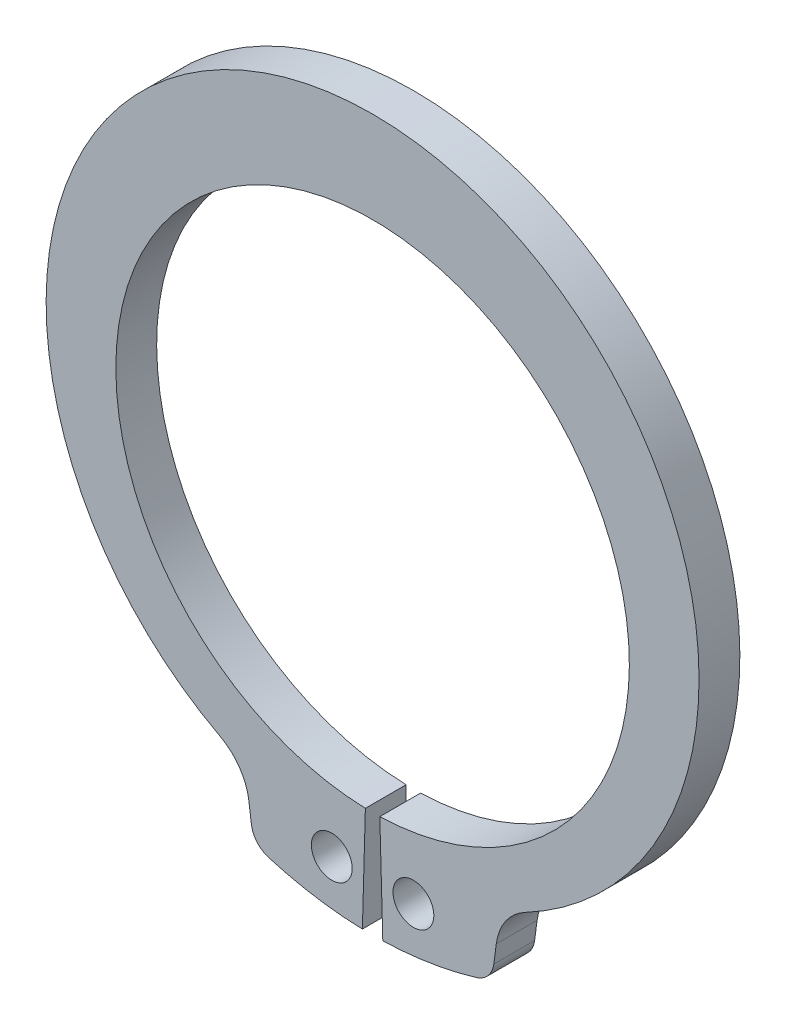
ISO-10303-21;
HEADER;
FILE_DESCRIPTION(('STEP AP214'),'2;1');
FILE_NAME('part.step','',(''),(''),'','','');
FILE_SCHEMA(('AUTOMOTIVE_DESIGN { 1 0 10303 214 1 1 1 1 }'));
ENDSEC;
DATA;
#1=APPLICATION_CONTEXT('core data for automotive mechanical design processes');
#2=APPLICATION_PROTOCOL_DEFINITION('international standard','automotive_design',2000,#1);
#3=PRODUCT_CONTEXT('',#1,'mechanical');
#4=PRODUCT('Part','Part','',(#3));
#5=PRODUCT_RELATED_PRODUCT_CATEGORY('part','',(#4));
#6=PRODUCT_DEFINITION_FORMATION('','',#4);
#7=PRODUCT_DEFINITION_CONTEXT('part definition',#1,'design');
#8=PRODUCT_DEFINITION('design','',#6,#7);
#9=PRODUCT_DEFINITION_SHAPE('','',#8);
#10=(LENGTH_UNIT() NAMED_UNIT(*) SI_UNIT(.MILLI.,.METRE.));
#11=(NAMED_UNIT(*) PLANE_ANGLE_UNIT() SI_UNIT($,.RADIAN.));
#12=(NAMED_UNIT(*) SI_UNIT($,.STERADIAN.) SOLID_ANGLE_UNIT());
#13=UNCERTAINTY_MEASURE_WITH_UNIT(LENGTH_MEASURE(1.E-05),#10,'distance_accuracy_value','');
#14=(GEOMETRIC_REPRESENTATION_CONTEXT(3) GLOBAL_UNCERTAINTY_ASSIGNED_CONTEXT((#13)) GLOBAL_UNIT_ASSIGNED_CONTEXT((#10,
#11,#12)) REPRESENTATION_CONTEXT('',''));
#15=CARTESIAN_POINT('',(0.,0.,0.));
#16=DIRECTION('',(0.,0.,1.));
#17=DIRECTION('',(1.,0.,0.));
#18=AXIS2_PLACEMENT_3D('',#15,#16,#17);
#19=CARTESIAN_POINT('',(0.,0.,-1.27));
#20=DIRECTION('',(0.,0.,1.));
#21=DIRECTION('',(1.,0.,0.));
#22=AXIS2_PLACEMENT_3D('',#19,#20,#21);
#23=CYLINDRICAL_SURFACE('',#22,7.9883);
#24=CARTESIAN_POINT('',(0.,0.,0.));
#25=DIRECTION('',(0.,0.,-1.));
#26=DIRECTION('',(1.,0.,0.));
#27=AXIS2_PLACEMENT_3D('',#24,#25,#26);
#28=CIRCLE('',#27,7.9883);
#29=CARTESIAN_POINT('',(-0.224642857142857,-7.98514072992672,0.));
#30=VERTEX_POINT('',#29);
#31=CARTESIAN_POINT('',(0.224642857142857,-7.98514072992672,0.));
#32=VERTEX_POINT('',#31);
#33=EDGE_CURVE('E160',#30,#32,#28,.T.);
#34=ORIENTED_EDGE('',*,*,#33,.F.);
#35=DIRECTION('',(0.,0.,1.));
#36=VECTOR('',#35,1.);
#37=CARTESIAN_POINT('',(-0.224642857142857,-7.98514072992672,-1.27));
#38=LINE('',#37,#36);
#39=CARTESIAN_POINT('',(-0.224642857142857,-7.98514072992672,-1.27));
#40=VERTEX_POINT('',#39);
#41=EDGE_CURVE('E11',#40,#30,#38,.T.);
#42=ORIENTED_EDGE('',*,*,#41,.F.);
#43=CARTESIAN_POINT('',(0.,0.,-1.27));
#44=DIRECTION('',(0.,0.,-1.));
#45=DIRECTION('',(1.,0.,0.));
#46=AXIS2_PLACEMENT_3D('',#43,#44,#45);
#47=CIRCLE('',#46,7.9883);
#48=CARTESIAN_POINT('',(0.224642857142857,-7.98514072992672,-1.27));
#49=VERTEX_POINT('',#48);
#50=EDGE_CURVE('E193',#40,#49,#47,.T.);
#51=ORIENTED_EDGE('',*,*,#50,.T.);
#52=DIRECTION('',(0.,0.,1.));
#53=VECTOR('',#52,1.);
#54=CARTESIAN_POINT('',(0.224642857142857,-7.98514072992672,-1.27));
#55=LINE('',#54,#53);
#56=EDGE_CURVE('E42',#49,#32,#55,.T.);
#57=ORIENTED_EDGE('',*,*,#56,.T.);
#58=EDGE_LOOP('',(#34,#42,#51,#57));
#59=FACE_BOUND('',#58,.T.);
#60=ADVANCED_FACE('F39',(#59),#23,.F.);
#61=CARTESIAN_POINT('',(-0.224642857142857,-7.98514072992672,-1.27));
#62=DIRECTION('',(0.99960451284087,-0.0281214848143982,0.));
#63=DIRECTION('',(0.0281214848143982,0.99960451284087,0.));
#64=AXIS2_PLACEMENT_3D('',#61,#62,#63);
#65=PLANE('',#64);
#66=DIRECTION('',(0.0281214848143982,0.99960451284087,0.));
#67=VECTOR('',#66,1.);
#68=CARTESIAN_POINT('',(-0.224642857142857,-7.98514072992672,0.));
#69=LINE('',#68,#67);
#70=CARTESIAN_POINT('',(-0.3175,-11.2858348313273,0.));
#71=VERTEX_POINT('',#70);
#72=EDGE_CURVE('E191',#71,#30,#69,.T.);
#73=ORIENTED_EDGE('',*,*,#72,.F.);
#74=DIRECTION('',(0.,0.,1.));
#75=VECTOR('',#74,1.);
#76=CARTESIAN_POINT('',(-0.3175,-11.2858348313273,-1.27));
#77=LINE('',#76,#75);
#78=CARTESIAN_POINT('',(-0.3175,-11.2858348313273,-1.27));
#79=VERTEX_POINT('',#78);
#80=EDGE_CURVE('E48',#79,#71,#77,.T.);
#81=ORIENTED_EDGE('',*,*,#80,.F.);
#82=DIRECTION('',(0.0281214848143982,0.99960451284087,0.));
#83=VECTOR('',#82,1.);
#84=CARTESIAN_POINT('',(-0.224642857142857,-7.98514072992672,-1.27));
#85=LINE('',#84,#83);
#86=EDGE_CURVE('E150',#79,#40,#85,.T.);
#87=ORIENTED_EDGE('',*,*,#86,.T.);
#88=ORIENTED_EDGE('',*,*,#41,.T.);
#89=EDGE_LOOP('',(#73,#81,#87,#88));
#90=FACE_BOUND('',#89,.T.);
#91=ADVANCED_FACE('F213',(#90),#65,.T.);
#92=CARTESIAN_POINT('',(0.,0.,-1.27));
#93=DIRECTION('',(0.,0.,1.));
#94=DIRECTION('',(1.,0.,0.));
#95=AXIS2_PLACEMENT_3D('',#92,#93,#94);
#96=CYLINDRICAL_SURFACE('',#95,11.2903);
#97=CARTESIAN_POINT('',(0.,0.,0.));
#98=DIRECTION('',(0.,0.,1.));
#99=DIRECTION('',(1.,0.,0.));
#100=AXIS2_PLACEMENT_3D('',#97,#98,#99);
#101=CIRCLE('',#100,11.2903);
#102=CARTESIAN_POINT('',(-3.23393725045339,-10.8172327307001,0.));
#103=VERTEX_POINT('',#102);
#104=EDGE_CURVE('E137',#103,#71,#101,.T.);
#105=ORIENTED_EDGE('',*,*,#104,.F.);
#106=DIRECTION('',(0.,0.,1.));
#107=VECTOR('',#106,1.);
#108=CARTESIAN_POINT('',(-3.23393725045339,-10.8172327307001,-1.27));
#109=LINE('',#108,#107);
#110=CARTESIAN_POINT('',(-3.23393725045339,-10.8172327307001,-1.27));
#111=VERTEX_POINT('',#110);
#112=EDGE_CURVE('E132',#111,#103,#109,.T.);
#113=ORIENTED_EDGE('',*,*,#112,.F.);
#114=CARTESIAN_POINT('',(0.,0.,-1.27));
#115=DIRECTION('',(0.,0.,1.));
#116=DIRECTION('',(1.,0.,0.));
#117=AXIS2_PLACEMENT_3D('',#114,#115,#116);
#118=CIRCLE('',#117,11.2903);
#119=EDGE_CURVE('E135',#111,#79,#118,.T.);
#120=ORIENTED_EDGE('',*,*,#119,.T.);
#121=ORIENTED_EDGE('',*,*,#80,.T.);
#122=EDGE_LOOP('',(#105,#113,#120,#121));
#123=FACE_BOUND('',#122,.T.);
#124=ADVANCED_FACE('F134',(#123),#96,.T.);
#125=CARTESIAN_POINT('',(-3.01567376898296,-10.0871607803717,-1.27));
#126=DIRECTION('',(0.,0.,1.));
#127=DIRECTION('',(1.,0.,0.));
#128=AXIS2_PLACEMENT_3D('',#125,#126,#127);
#129=CYLINDRICAL_SURFACE('',#128,0.761999999999999);
#130=CARTESIAN_POINT('',(-3.01567376898296,-10.0871607803717,0.));
#131=DIRECTION('',(0.,0.,1.));
#132=DIRECTION('',(1.,0.,0.));
#133=AXIS2_PLACEMENT_3D('',#130,#131,#132);
#134=CIRCLE('',#133,0.761999999999999);
#135=CARTESIAN_POINT('',(-3.7711547533498,-10.1866217388433,0.));
#136=VERTEX_POINT('',#135);
#137=EDGE_CURVE('E188',#136,#103,#134,.T.);
#138=ORIENTED_EDGE('',*,*,#137,.F.);
#139=DIRECTION('',(0.,0.,1.));
#140=VECTOR('',#139,1.);
#141=CARTESIAN_POINT('',(-3.7711547533498,-10.1866217388433,-1.27));
#142=LINE('',#141,#140);
#143=CARTESIAN_POINT('',(-3.7711547533498,-10.1866217388433,-1.27));
#144=VERTEX_POINT('',#143);
#145=EDGE_CURVE('E142',#144,#136,#142,.T.);
#146=ORIENTED_EDGE('',*,*,#145,.F.);
#147=CARTESIAN_POINT('',(-3.01567376898296,-10.0871607803717,-1.27));
#148=DIRECTION('',(0.,0.,1.));
#149=DIRECTION('',(1.,0.,0.));
#150=AXIS2_PLACEMENT_3D('',#147,#148,#149);
#151=CIRCLE('',#150,0.761999999999999);
#152=EDGE_CURVE('E148',#144,#111,#151,.T.);
#153=ORIENTED_EDGE('',*,*,#152,.T.);
#154=ORIENTED_EDGE('',*,*,#112,.T.);
#155=EDGE_LOOP('',(#138,#146,#153,#154));
#156=FACE_BOUND('',#155,.T.);
#157=ADVANCED_FACE('F152',(#156),#129,.T.);
#158=CARTESIAN_POINT('',(-3.84824238590232,-9.60108303684231,-1.27));
#159=DIRECTION('',(-0.99144486137381,-0.130526192220053,0.));
#160=DIRECTION('',(0.130526192220053,-0.99144486137381,0.));
#161=AXIS2_PLACEMENT_3D('',#158,#159,#160);
#162=PLANE('',#161);
#163=DIRECTION('',(0.130526192220053,-0.99144486137381,0.));
#164=VECTOR('',#163,1.);
#165=CARTESIAN_POINT('',(-3.84824238590232,-9.60108303684231,0.));
#166=LINE('',#165,#164);
#167=CARTESIAN_POINT('',(-3.84824238590232,-9.60108303684231,0.));
#168=VERTEX_POINT('',#167);
#169=EDGE_CURVE('E185',#168,#136,#166,.T.);
#170=ORIENTED_EDGE('',*,*,#169,.F.);
#171=DIRECTION('',(0.,0.,1.));
#172=VECTOR('',#171,1.);
#173=CARTESIAN_POINT('',(-3.84824238590232,-9.60108303684231,-1.27));
#174=LINE('',#173,#172);
#175=CARTESIAN_POINT('',(-3.84824238590232,-9.60108303684231,-1.27));
#176=VERTEX_POINT('',#175);
#177=EDGE_CURVE('E197',#176,#168,#174,.T.);
#178=ORIENTED_EDGE('',*,*,#177,.F.);
#179=DIRECTION('',(0.130526192220053,-0.99144486137381,0.));
#180=VECTOR('',#179,1.);
#181=CARTESIAN_POINT('',(-3.84824238590232,-9.60108303684231,-1.27));
#182=LINE('',#181,#180);
#183=EDGE_CURVE('E153',#176,#144,#182,.T.);
#184=ORIENTED_EDGE('',*,*,#183,.T.);
#185=ORIENTED_EDGE('',*,*,#145,.T.);
#186=EDGE_LOOP('',(#170,#178,#184,#185));
#187=FACE_BOUND('',#186,.T.);
#188=ADVANCED_FACE('F226',(#187),#162,.T.);
#189=CARTESIAN_POINT('',(-5.55987941008073,-9.82642432603846,-1.27));
#190=DIRECTION('',(0.,0.,1.));
#191=DIRECTION('',(1.,0.,0.));
#192=AXIS2_PLACEMENT_3D('',#189,#190,#191);
#193=CYLINDRICAL_SURFACE('',#192,1.72640667258758);
#194=CARTESIAN_POINT('',(-5.55987941008073,-9.82642432603846,0.));
#195=DIRECTION('',(0.,0.,-1.));
#196=DIRECTION('',(1.,0.,0.));
#197=AXIS2_PLACEMENT_3D('',#194,#195,#196);
#198=CIRCLE('',#197,1.72640667258758);
#199=CARTESIAN_POINT('',(-4.75214686488475,-8.3006300625199,0.));
#200=VERTEX_POINT('',#199);
#201=EDGE_CURVE('E182',#200,#168,#198,.T.);
#202=ORIENTED_EDGE('',*,*,#201,.F.);
#203=DIRECTION('',(0.,0.,1.));
#204=VECTOR('',#203,1.);
#205=CARTESIAN_POINT('',(-4.75214686488475,-8.3006300625199,-1.27));
#206=LINE('',#205,#204);
#207=CARTESIAN_POINT('',(-4.75214686488475,-8.3006300625199,-1.27));
#208=VERTEX_POINT('',#207);
#209=EDGE_CURVE('E199',#208,#200,#206,.T.);
#210=ORIENTED_EDGE('',*,*,#209,.F.);
#211=CARTESIAN_POINT('',(-5.55987941008073,-9.82642432603846,-1.27));
#212=DIRECTION('',(0.,0.,-1.));
#213=DIRECTION('',(1.,0.,0.));
#214=AXIS2_PLACEMENT_3D('',#211,#212,#213);
#215=CIRCLE('',#214,1.72640667258758);
#216=EDGE_CURVE('E155',#208,#176,#215,.T.);
#217=ORIENTED_EDGE('',*,*,#216,.T.);
#218=ORIENTED_EDGE('',*,*,#177,.T.);
#219=EDGE_LOOP('',(#202,#210,#217,#218));
#220=FACE_BOUND('',#219,.T.);
#221=ADVANCED_FACE('F229',(#220),#193,.F.);
#222=CARTESIAN_POINT('',(0.,0.67610173931631,-1.27));
#223=DIRECTION('',(0.,0.,1.));
#224=DIRECTION('',(1.,0.,0.));
#225=AXIS2_PLACEMENT_3D('',#222,#223,#224);
#226=CYLINDRICAL_SURFACE('',#225,10.1569982606837);
#227=CARTESIAN_POINT('',(0.,0.67610173931631,0.));
#228=DIRECTION('',(0.,0.,1.));
#229=DIRECTION('',(1.,0.,0.));
#230=AXIS2_PLACEMENT_3D('',#227,#228,#229);
#231=CIRCLE('',#230,10.1569982606837);
#232=CARTESIAN_POINT('',(4.75214686488475,-8.3006300625199,0.));
#233=VERTEX_POINT('',#232);
#234=EDGE_CURVE('E179',#233,#200,#231,.T.);
#235=ORIENTED_EDGE('',*,*,#234,.F.);
#236=DIRECTION('',(0.,0.,1.));
#237=VECTOR('',#236,1.);
#238=CARTESIAN_POINT('',(4.75214686488475,-8.3006300625199,-1.27));
#239=LINE('',#238,#237);
#240=CARTESIAN_POINT('',(4.75214686488475,-8.3006300625199,-1.27));
#241=VERTEX_POINT('',#240);
#242=EDGE_CURVE('E201',#241,#233,#239,.T.);
#243=ORIENTED_EDGE('',*,*,#242,.F.);
#244=CARTESIAN_POINT('',(0.,0.67610173931631,-1.27));
#245=DIRECTION('',(0.,0.,1.));
#246=DIRECTION('',(1.,0.,0.));
#247=AXIS2_PLACEMENT_3D('',#244,#245,#246);
#248=CIRCLE('',#247,10.1569982606837);
#249=EDGE_CURVE('E303',#241,#208,#248,.T.);
#250=ORIENTED_EDGE('',*,*,#249,.T.);
#251=ORIENTED_EDGE('',*,*,#209,.T.);
#252=EDGE_LOOP('',(#235,#243,#250,#251));
#253=FACE_BOUND('',#252,.T.);
#254=ADVANCED_FACE('F233',(#253),#226,.T.);
#255=CARTESIAN_POINT('',(5.55987941008073,-9.82642432603846,-1.27));
#256=DIRECTION('',(0.,0.,1.));
#257=DIRECTION('',(1.,0.,0.));
#258=AXIS2_PLACEMENT_3D('',#255,#256,#257);
#259=CYLINDRICAL_SURFACE('',#258,1.72640667258758);
#260=CARTESIAN_POINT('',(5.55987941008073,-9.82642432603846,0.));
#261=DIRECTION('',(0.,0.,-1.));
#262=DIRECTION('',(1.,0.,0.));
#263=AXIS2_PLACEMENT_3D('',#260,#261,#262);
#264=CIRCLE('',#263,1.72640667258758);
#265=CARTESIAN_POINT('',(3.84824238590232,-9.60108303684231,0.));
#266=VERTEX_POINT('',#265);
#267=EDGE_CURVE('E176',#266,#233,#264,.T.);
#268=ORIENTED_EDGE('',*,*,#267,.F.);
#269=DIRECTION('',(0.,0.,1.));
#270=VECTOR('',#269,1.);
#271=CARTESIAN_POINT('',(3.84824238590232,-9.60108303684231,-1.27));
#272=LINE('',#271,#270);
#273=CARTESIAN_POINT('',(3.84824238590232,-9.60108303684231,-1.27));
#274=VERTEX_POINT('',#273);
#275=EDGE_CURVE('E203',#274,#266,#272,.T.);
#276=ORIENTED_EDGE('',*,*,#275,.F.);
#277=CARTESIAN_POINT('',(5.55987941008073,-9.82642432603846,-1.27));
#278=DIRECTION('',(0.,0.,-1.));
#279=DIRECTION('',(1.,0.,0.));
#280=AXIS2_PLACEMENT_3D('',#277,#278,#279);
#281=CIRCLE('',#280,1.72640667258758);
#282=EDGE_CURVE('E300',#274,#241,#281,.T.);
#283=ORIENTED_EDGE('',*,*,#282,.T.);
#284=ORIENTED_EDGE('',*,*,#242,.T.);
#285=EDGE_LOOP('',(#268,#276,#283,#284));
#286=FACE_BOUND('',#285,.T.);
#287=ADVANCED_FACE('F237',(#286),#259,.F.);
#288=CARTESIAN_POINT('',(3.84824238590232,-9.60108303684231,-1.27));
#289=DIRECTION('',(0.99144486137381,-0.130526192220053,0.));
#290=DIRECTION('',(0.130526192220053,0.99144486137381,0.));
#291=AXIS2_PLACEMENT_3D('',#288,#289,#290);
#292=PLANE('',#291);
#293=DIRECTION('',(0.130526192220053,0.99144486137381,0.));
#294=VECTOR('',#293,1.);
#295=CARTESIAN_POINT('',(3.84824238590232,-9.60108303684231,0.));
#296=LINE('',#295,#294);
#297=CARTESIAN_POINT('',(3.7711547533498,-10.1866217388433,0.));
#298=VERTEX_POINT('',#297);
#299=EDGE_CURVE('E173',#298,#266,#296,.T.);
#300=ORIENTED_EDGE('',*,*,#299,.F.);
#301=DIRECTION('',(0.,0.,1.));
#302=VECTOR('',#301,1.);
#303=CARTESIAN_POINT('',(3.7711547533498,-10.1866217388433,-1.27));
#304=LINE('',#303,#302);
#305=CARTESIAN_POINT('',(3.7711547533498,-10.1866217388433,-1.27));
#306=VERTEX_POINT('',#305);
#307=EDGE_CURVE('E205',#306,#298,#304,.T.);
#308=ORIENTED_EDGE('',*,*,#307,.F.);
#309=DIRECTION('',(0.130526192220053,0.99144486137381,0.));
#310=VECTOR('',#309,1.);
#311=CARTESIAN_POINT('',(3.84824238590232,-9.60108303684231,-1.27));
#312=LINE('',#311,#310);
#313=EDGE_CURVE('E297',#306,#274,#312,.T.);
#314=ORIENTED_EDGE('',*,*,#313,.T.);
#315=ORIENTED_EDGE('',*,*,#275,.T.);
#316=EDGE_LOOP('',(#300,#308,#314,#315));
#317=FACE_BOUND('',#316,.T.);
#318=ADVANCED_FACE('F241',(#317),#292,.T.);
#319=CARTESIAN_POINT('',(3.01567376898296,-10.0871607803717,-1.27));
#320=DIRECTION('',(0.,0.,1.));
#321=DIRECTION('',(1.,0.,0.));
#322=AXIS2_PLACEMENT_3D('',#319,#320,#321);
#323=CYLINDRICAL_SURFACE('',#322,0.761999999999999);
#324=CARTESIAN_POINT('',(3.01567376898296,-10.0871607803717,0.));
#325=DIRECTION('',(0.,0.,1.));
#326=DIRECTION('',(-1.,0.,0.));
#327=AXIS2_PLACEMENT_3D('',#324,#325,#326);
#328=CIRCLE('',#327,0.761999999999999);
#329=CARTESIAN_POINT('',(3.23393725045338,-10.8172327307001,0.));
#330=VERTEX_POINT('',#329);
#331=EDGE_CURVE('E170',#330,#298,#328,.T.);
#332=ORIENTED_EDGE('',*,*,#331,.F.);
#333=DIRECTION('',(0.,0.,1.));
#334=VECTOR('',#333,1.);
#335=CARTESIAN_POINT('',(3.23393725045338,-10.8172327307001,-1.27));
#336=LINE('',#335,#334);
#337=CARTESIAN_POINT('',(3.23393725045338,-10.8172327307001,-1.27));
#338=VERTEX_POINT('',#337);
#339=EDGE_CURVE('E207',#338,#330,#336,.T.);
#340=ORIENTED_EDGE('',*,*,#339,.F.);
#341=CARTESIAN_POINT('',(3.01567376898296,-10.0871607803717,-1.27));
#342=DIRECTION('',(0.,0.,1.));
#343=DIRECTION('',(-1.,0.,0.));
#344=AXIS2_PLACEMENT_3D('',#341,#342,#343);
#345=CIRCLE('',#344,0.761999999999999);
#346=EDGE_CURVE('E294',#338,#306,#345,.T.);
#347=ORIENTED_EDGE('',*,*,#346,.T.);
#348=ORIENTED_EDGE('',*,*,#307,.T.);
#349=EDGE_LOOP('',(#332,#340,#347,#348));
#350=FACE_BOUND('',#349,.T.);
#351=ADVANCED_FACE('F245',(#350),#323,.T.);
#352=CARTESIAN_POINT('',(0.,0.,-1.27));
#353=DIRECTION('',(0.,0.,1.));
#354=DIRECTION('',(1.,0.,0.));
#355=AXIS2_PLACEMENT_3D('',#352,#353,#354);
#356=CYLINDRICAL_SURFACE('',#355,11.2903);
#357=CARTESIAN_POINT('',(0.,0.,0.));
#358=DIRECTION('',(0.,0.,1.));
#359=DIRECTION('',(1.,0.,0.));
#360=AXIS2_PLACEMENT_3D('',#357,#358,#359);
#361=CIRCLE('',#360,11.2903);
#362=CARTESIAN_POINT('',(0.317499999999994,-11.2858348313273,0.));
#363=VERTEX_POINT('',#362);
#364=EDGE_CURVE('E167',#363,#330,#361,.T.);
#365=ORIENTED_EDGE('',*,*,#364,.F.);
#366=DIRECTION('',(0.,0.,1.));
#367=VECTOR('',#366,1.);
#368=CARTESIAN_POINT('',(0.317499999999994,-11.2858348313273,-1.27));
#369=LINE('',#368,#367);
#370=CARTESIAN_POINT('',(0.317499999999994,-11.2858348313273,-1.27));
#371=VERTEX_POINT('',#370);
#372=EDGE_CURVE('E208',#371,#363,#369,.T.);
#373=ORIENTED_EDGE('',*,*,#372,.F.);
#374=CARTESIAN_POINT('',(0.,0.,-1.27));
#375=DIRECTION('',(0.,0.,1.));
#376=DIRECTION('',(1.,0.,0.));
#377=AXIS2_PLACEMENT_3D('',#374,#375,#376);
#378=CIRCLE('',#377,11.2903);
#379=EDGE_CURVE('E291',#371,#338,#378,.T.);
#380=ORIENTED_EDGE('',*,*,#379,.T.);
#381=ORIENTED_EDGE('',*,*,#339,.T.);
#382=EDGE_LOOP('',(#365,#373,#380,#381));
#383=FACE_BOUND('',#382,.T.);
#384=ADVANCED_FACE('F249',(#383),#356,.T.);
#385=CARTESIAN_POINT('',(0.224642857142857,-7.98514072992672,-1.27));
#386=DIRECTION('',(-0.99960451284087,-0.0281214848143982,0.));
#387=DIRECTION('',(0.0281214848143982,-0.99960451284087,0.));
#388=AXIS2_PLACEMENT_3D('',#385,#386,#387);
#389=PLANE('',#388);
#390=DIRECTION('',(0.0281214848143982,-0.99960451284087,0.));
#391=VECTOR('',#390,1.);
#392=CARTESIAN_POINT('',(0.224642857142857,-7.98514072992672,0.));
#393=LINE('',#392,#391);
#394=EDGE_CURVE('E163',#32,#363,#393,.T.);
#395=ORIENTED_EDGE('',*,*,#394,.F.);
#396=ORIENTED_EDGE('',*,*,#56,.F.);
#397=DIRECTION('',(0.0281214848143982,-0.99960451284087,0.));
#398=VECTOR('',#397,1.);
#399=CARTESIAN_POINT('',(0.224642857142857,-7.98514072992672,-1.27));
#400=LINE('',#399,#398);
#401=EDGE_CURVE('E289',#49,#371,#400,.T.);
#402=ORIENTED_EDGE('',*,*,#401,.T.);
#403=ORIENTED_EDGE('',*,*,#372,.T.);
#404=EDGE_LOOP('',(#395,#396,#402,#403));
#405=FACE_BOUND('',#404,.T.);
#406=ADVANCED_FACE('F210',(#405),#389,.T.);
#407=CARTESIAN_POINT('',(0.,0.,-1.27));
#408=DIRECTION('',(0.,0.,1.));
#409=DIRECTION('',(1.,0.,0.));
#410=AXIS2_PLACEMENT_3D('',#407,#408,#409);
#411=PLANE('',#410);
#412=CARTESIAN_POINT('',(-1.27,-9.81144662575301,-1.27));
#413=DIRECTION('',(0.,0.,1.));
#414=DIRECTION('',(1.,0.,0.));
#415=AXIS2_PLACEMENT_3D('',#412,#413,#414);
#416=CIRCLE('',#415,0.635);
#417=CARTESIAN_POINT('',(-0.635,-9.81144662575301,-1.27));
#418=VERTEX_POINT('',#417);
#419=EDGE_CURVE('E276',#418,#418,#416,.T.);
#420=ORIENTED_EDGE('',*,*,#419,.T.);
#421=EDGE_LOOP('',(#420));
#422=FACE_BOUND('',#421,.T.);
#423=CARTESIAN_POINT('',(1.27,-9.81144662575301,-1.27));
#424=DIRECTION('',(0.,0.,1.));
#425=DIRECTION('',(1.,0.,0.));
#426=AXIS2_PLACEMENT_3D('',#423,#424,#425);
#427=CIRCLE('',#426,0.635);
#428=CARTESIAN_POINT('',(1.905,-9.81144662575301,-1.27));
#429=VERTEX_POINT('',#428);
#430=EDGE_CURVE('E164',#429,#429,#427,.T.);
#431=ORIENTED_EDGE('',*,*,#430,.T.);
#432=EDGE_LOOP('',(#431));
#433=FACE_BOUND('',#432,.T.);
#434=ORIENTED_EDGE('',*,*,#50,.F.);
#435=ORIENTED_EDGE('',*,*,#86,.F.);
#436=ORIENTED_EDGE('',*,*,#119,.F.);
#437=ORIENTED_EDGE('',*,*,#152,.F.);
#438=ORIENTED_EDGE('',*,*,#183,.F.);
#439=ORIENTED_EDGE('',*,*,#216,.F.);
#440=ORIENTED_EDGE('',*,*,#249,.F.);
#441=ORIENTED_EDGE('',*,*,#282,.F.);
#442=ORIENTED_EDGE('',*,*,#313,.F.);
#443=ORIENTED_EDGE('',*,*,#346,.F.);
#444=ORIENTED_EDGE('',*,*,#379,.F.);
#445=ORIENTED_EDGE('',*,*,#401,.F.);
#446=EDGE_LOOP('',(#434,#435,#436,#437,#438,#439,#440,#441,#442,#443,#444,#445));
#447=FACE_BOUND('',#446,.T.);
#448=ADVANCED_FACE('F146',(#422,#433,#447),#411,.F.);
#449=CARTESIAN_POINT('',(0.,0.,0.));
#450=DIRECTION('',(0.,0.,1.));
#451=DIRECTION('',(1.,0.,0.));
#452=AXIS2_PLACEMENT_3D('',#449,#450,#451);
#453=PLANE('',#452);
#454=CARTESIAN_POINT('',(-1.27,-9.81144662575301,0.));
#455=DIRECTION('',(0.,0.,1.));
#456=DIRECTION('',(1.,0.,0.));
#457=AXIS2_PLACEMENT_3D('',#454,#455,#456);
#458=CIRCLE('',#457,0.635);
#459=CARTESIAN_POINT('',(-0.635,-9.81144662575301,0.));
#460=VERTEX_POINT('',#459);
#461=EDGE_CURVE('E279',#460,#460,#458,.T.);
#462=ORIENTED_EDGE('',*,*,#461,.F.);
#463=EDGE_LOOP('',(#462));
#464=FACE_BOUND('',#463,.T.);
#465=CARTESIAN_POINT('',(1.27,-9.81144662575301,0.));
#466=DIRECTION('',(0.,0.,1.));
#467=DIRECTION('',(1.,0.,0.));
#468=AXIS2_PLACEMENT_3D('',#465,#466,#467);
#469=CIRCLE('',#468,0.635);
#470=CARTESIAN_POINT('',(1.905,-9.81144662575301,0.));
#471=VERTEX_POINT('',#470);
#472=EDGE_CURVE('E281',#471,#471,#469,.T.);
#473=ORIENTED_EDGE('',*,*,#472,.F.);
#474=EDGE_LOOP('',(#473));
#475=FACE_BOUND('',#474,.T.);
#476=ORIENTED_EDGE('',*,*,#33,.T.);
#477=ORIENTED_EDGE('',*,*,#394,.T.);
#478=ORIENTED_EDGE('',*,*,#364,.T.);
#479=ORIENTED_EDGE('',*,*,#331,.T.);
#480=ORIENTED_EDGE('',*,*,#299,.T.);
#481=ORIENTED_EDGE('',*,*,#267,.T.);
#482=ORIENTED_EDGE('',*,*,#234,.T.);
#483=ORIENTED_EDGE('',*,*,#201,.T.);
#484=ORIENTED_EDGE('',*,*,#169,.T.);
#485=ORIENTED_EDGE('',*,*,#137,.T.);
#486=ORIENTED_EDGE('',*,*,#104,.T.);
#487=ORIENTED_EDGE('',*,*,#72,.T.);
#488=EDGE_LOOP('',(#476,#477,#478,#479,#480,#481,#482,#483,#484,#485,#486,#487));
#489=FACE_BOUND('',#488,.T.);
#490=ADVANCED_FACE('F212',(#464,#475,#489),#453,.T.);
#491=CARTESIAN_POINT('',(1.27,-9.81144662575301,-1.27));
#492=DIRECTION('',(0.,0.,1.));
#493=DIRECTION('',(1.,0.,0.));
#494=AXIS2_PLACEMENT_3D('',#491,#492,#493);
#495=CYLINDRICAL_SURFACE('',#494,0.635);
#496=ORIENTED_EDGE('',*,*,#430,.F.);
#497=EDGE_LOOP('',(#496));
#498=FACE_BOUND('',#497,.T.);
#499=ORIENTED_EDGE('',*,*,#472,.T.);
#500=EDGE_LOOP('',(#499));
#501=FACE_BOUND('',#500,.T.);
#502=ADVANCED_FACE('F261',(#498,#501),#495,.F.);
#503=CARTESIAN_POINT('',(-1.27,-9.81144662575301,-1.27));
#504=DIRECTION('',(0.,0.,1.));
#505=DIRECTION('',(1.,0.,0.));
#506=AXIS2_PLACEMENT_3D('',#503,#504,#505);
#507=CYLINDRICAL_SURFACE('',#506,0.635);
#508=ORIENTED_EDGE('',*,*,#419,.F.);
#509=EDGE_LOOP('',(#508));
#510=FACE_BOUND('',#509,.T.);
#511=ORIENTED_EDGE('',*,*,#461,.T.);
#512=EDGE_LOOP('',(#511));
#513=FACE_BOUND('',#512,.T.);
#514=ADVANCED_FACE('F268',(#510,#513),#507,.F.);
#515=CLOSED_SHELL('',(#60,#91,#124,#157,#188,#221,#254,#287,#318,#351,#384,#406,#448,#490,#502,#514));
#516=MANIFOLD_SOLID_BREP('B2',#515);
#517=ADVANCED_BREP_SHAPE_REPRESENTATION('',(#18,#516),#14);
#518=SHAPE_DEFINITION_REPRESENTATION(#9,#517);
ENDSEC;
END-ISO-10303-21;
